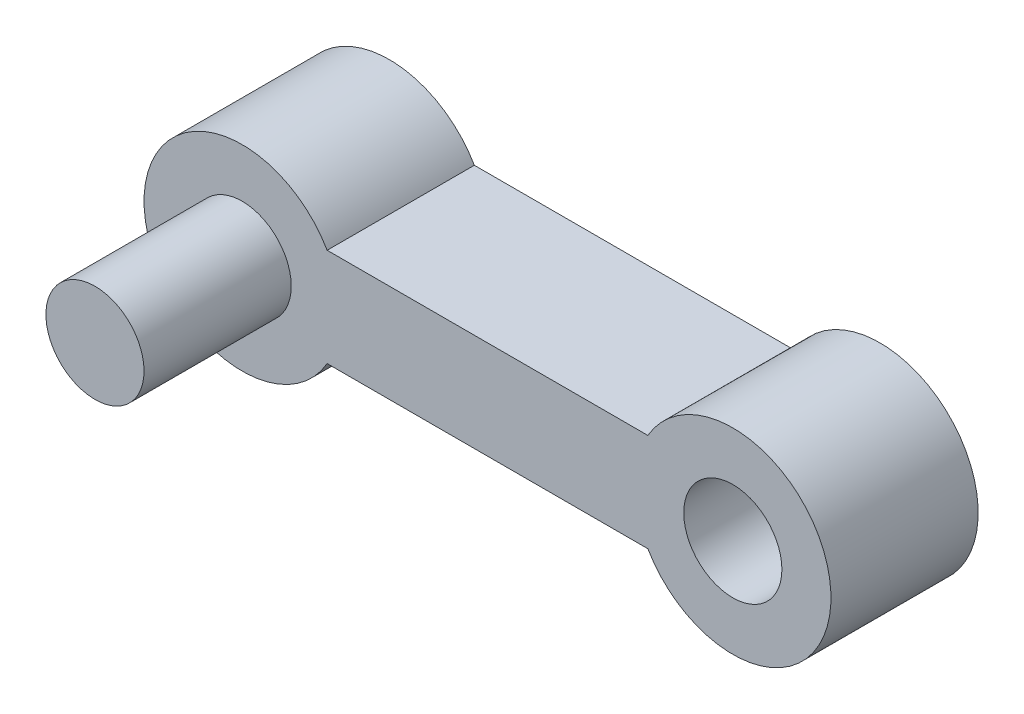
ISO-10303-21;
HEADER;
FILE_DESCRIPTION(('STEP AP214'),'2;1');
FILE_NAME('part.step','',(''),(''),'','','');
FILE_SCHEMA(('AUTOMOTIVE_DESIGN { 1 0 10303 214 1 1 1 1 }'));
ENDSEC;
DATA;
#1=APPLICATION_CONTEXT('core data for automotive mechanical design processes');
#2=APPLICATION_PROTOCOL_DEFINITION('international standard','automotive_design',2000,#1);
#3=PRODUCT_CONTEXT('',#1,'mechanical');
#4=PRODUCT('Part','Part','',(#3));
#5=PRODUCT_RELATED_PRODUCT_CATEGORY('part','',(#4));
#6=PRODUCT_DEFINITION_FORMATION('','',#4);
#7=PRODUCT_DEFINITION_CONTEXT('part definition',#1,'design');
#8=PRODUCT_DEFINITION('design','',#6,#7);
#9=PRODUCT_DEFINITION_SHAPE('','',#8);
#10=(LENGTH_UNIT() NAMED_UNIT(*) SI_UNIT(.MILLI.,.METRE.));
#11=(NAMED_UNIT(*) PLANE_ANGLE_UNIT() SI_UNIT($,.RADIAN.));
#12=(NAMED_UNIT(*) SI_UNIT($,.STERADIAN.) SOLID_ANGLE_UNIT());
#13=UNCERTAINTY_MEASURE_WITH_UNIT(LENGTH_MEASURE(1.E-05),#10,'distance_accuracy_value','');
#14=(GEOMETRIC_REPRESENTATION_CONTEXT(3) GLOBAL_UNCERTAINTY_ASSIGNED_CONTEXT((#13)) GLOBAL_UNIT_ASSIGNED_CONTEXT((#10,
#11,#12)) REPRESENTATION_CONTEXT('',''));
#15=CARTESIAN_POINT('',(0.,0.,0.));
#16=DIRECTION('',(0.,0.,1.));
#17=DIRECTION('',(1.,0.,0.));
#18=AXIS2_PLACEMENT_3D('',#15,#16,#17);
#19=CARTESIAN_POINT('',(-38.2370553074588,12.8003400418104,3.));
#20=DIRECTION('',(0.,0.,-1.));
#21=DIRECTION('',(-1.,0.,0.));
#22=AXIS2_PLACEMENT_3D('',#19,#20,#21);
#23=CYLINDRICAL_SURFACE('',#22,2.);
#24=CARTESIAN_POINT('',(-38.2370553074588,12.8003400418104,0.));
#25=DIRECTION('',(0.,0.,1.));
#26=DIRECTION('',(1.,0.,0.));
#27=AXIS2_PLACEMENT_3D('',#24,#25,#26);
#28=CIRCLE('',#27,2.);
#29=CARTESIAN_POINT('',(-36.50500449989,13.8003400418104,0.));
#30=VERTEX_POINT('',#29);
#31=CARTESIAN_POINT('',(-36.50500449989,11.8003400418104,0.));
#32=VERTEX_POINT('',#31);
#33=EDGE_CURVE('E103',#30,#32,#28,.T.);
#34=ORIENTED_EDGE('',*,*,#33,.T.);
#35=DIRECTION('',(0.,0.,-1.));
#36=VECTOR('',#35,1.);
#37=CARTESIAN_POINT('',(-36.50500449989,11.8003400418104,3.));
#38=LINE('',#37,#36);
#39=CARTESIAN_POINT('',(-36.50500449989,11.8003400418104,3.));
#40=VERTEX_POINT('',#39);
#41=EDGE_CURVE('E40',#40,#32,#38,.T.);
#42=ORIENTED_EDGE('',*,*,#41,.F.);
#43=CARTESIAN_POINT('',(-38.2370553074588,12.8003400418104,3.));
#44=DIRECTION('',(0.,0.,1.));
#45=DIRECTION('',(1.,0.,0.));
#46=AXIS2_PLACEMENT_3D('',#43,#44,#45);
#47=CIRCLE('',#46,2.);
#48=CARTESIAN_POINT('',(-36.50500449989,13.8003400418104,3.));
#49=VERTEX_POINT('',#48);
#50=EDGE_CURVE('E88',#49,#40,#47,.T.);
#51=ORIENTED_EDGE('',*,*,#50,.F.);
#52=DIRECTION('',(0.,0.,-1.));
#53=VECTOR('',#52,1.);
#54=CARTESIAN_POINT('',(-36.50500449989,13.8003400418104,3.));
#55=LINE('',#54,#53);
#56=EDGE_CURVE('E54',#49,#30,#55,.T.);
#57=ORIENTED_EDGE('',*,*,#56,.T.);
#58=EDGE_LOOP('',(#34,#42,#51,#57));
#59=FACE_BOUND('',#58,.T.);
#60=ADVANCED_FACE('F37',(#59),#23,.T.);
#61=CARTESIAN_POINT('',(0.,11.8003400418104,3.));
#62=DIRECTION('',(0.,1.,0.));
#63=DIRECTION('',(0.,0.,1.));
#64=AXIS2_PLACEMENT_3D('',#61,#62,#63);
#65=PLANE('',#64);
#66=DIRECTION('',(1.,0.,0.));
#67=VECTOR('',#66,1.);
#68=CARTESIAN_POINT('',(0.,11.8003400418104,0.));
#69=LINE('',#68,#67);
#70=CARTESIAN_POINT('',(-29.9691061150277,11.8003400418104,0.));
#71=VERTEX_POINT('',#70);
#72=EDGE_CURVE('E94',#32,#71,#69,.T.);
#73=ORIENTED_EDGE('',*,*,#72,.T.);
#74=DIRECTION('',(0.,0.,-1.));
#75=VECTOR('',#74,1.);
#76=CARTESIAN_POINT('',(-29.9691061150277,11.8003400418104,3.));
#77=LINE('',#76,#75);
#78=CARTESIAN_POINT('',(-29.9691061150277,11.8003400418104,3.));
#79=VERTEX_POINT('',#78);
#80=EDGE_CURVE('E92',#79,#71,#77,.T.);
#81=ORIENTED_EDGE('',*,*,#80,.F.);
#82=DIRECTION('',(1.,0.,0.));
#83=VECTOR('',#82,1.);
#84=CARTESIAN_POINT('',(0.,11.8003400418104,3.));
#85=LINE('',#84,#83);
#86=EDGE_CURVE('E80',#40,#79,#85,.T.);
#87=ORIENTED_EDGE('',*,*,#86,.F.);
#88=ORIENTED_EDGE('',*,*,#41,.T.);
#89=EDGE_LOOP('',(#73,#81,#87,#88));
#90=FACE_BOUND('',#89,.T.);
#91=ADVANCED_FACE('F93',(#90),#65,.F.);
#92=CARTESIAN_POINT('',(-28.2370553074588,12.8003400418104,3.));
#93=DIRECTION('',(0.,0.,-1.));
#94=DIRECTION('',(-1.,0.,0.));
#95=AXIS2_PLACEMENT_3D('',#92,#93,#94);
#96=CYLINDRICAL_SURFACE('',#95,2.);
#97=CARTESIAN_POINT('',(-28.2370553074588,12.8003400418104,0.));
#98=DIRECTION('',(0.,0.,1.));
#99=DIRECTION('',(1.,0.,0.));
#100=AXIS2_PLACEMENT_3D('',#97,#98,#99);
#101=CIRCLE('',#100,2.);
#102=CARTESIAN_POINT('',(-29.9691061150277,13.8003400418104,0.));
#103=VERTEX_POINT('',#102);
#104=EDGE_CURVE('E107',#103,#71,#101,.F.);
#105=ORIENTED_EDGE('',*,*,#104,.F.);
#106=DIRECTION('',(0.,0.,-1.));
#107=VECTOR('',#106,1.);
#108=CARTESIAN_POINT('',(-29.9691061150277,13.8003400418104,3.));
#109=LINE('',#108,#107);
#110=CARTESIAN_POINT('',(-29.9691061150277,13.8003400418104,3.));
#111=VERTEX_POINT('',#110);
#112=EDGE_CURVE('E68',#111,#103,#109,.T.);
#113=ORIENTED_EDGE('',*,*,#112,.F.);
#114=CARTESIAN_POINT('',(-28.2370553074588,12.8003400418104,3.));
#115=DIRECTION('',(0.,0.,1.));
#116=DIRECTION('',(1.,0.,0.));
#117=AXIS2_PLACEMENT_3D('',#114,#115,#116);
#118=CIRCLE('',#117,2.);
#119=EDGE_CURVE('E87',#111,#79,#118,.F.);
#120=ORIENTED_EDGE('',*,*,#119,.T.);
#121=ORIENTED_EDGE('',*,*,#80,.T.);
#122=EDGE_LOOP('',(#105,#113,#120,#121));
#123=FACE_BOUND('',#122,.T.);
#124=ADVANCED_FACE('F97',(#123),#96,.T.);
#125=CARTESIAN_POINT('',(0.,13.8003400418104,3.));
#126=DIRECTION('',(0.,1.,0.));
#127=DIRECTION('',(-1.,0.,0.));
#128=AXIS2_PLACEMENT_3D('',#125,#126,#127);
#129=PLANE('',#128);
#130=DIRECTION('',(1.,0.,0.));
#131=VECTOR('',#130,1.);
#132=CARTESIAN_POINT('',(0.,13.8003400418104,0.));
#133=LINE('',#132,#131);
#134=EDGE_CURVE('E109',#30,#103,#133,.T.);
#135=ORIENTED_EDGE('',*,*,#134,.F.);
#136=ORIENTED_EDGE('',*,*,#56,.F.);
#137=DIRECTION('',(1.,0.,0.));
#138=VECTOR('',#137,1.);
#139=CARTESIAN_POINT('',(0.,13.8003400418104,3.));
#140=LINE('',#139,#138);
#141=EDGE_CURVE('E98',#49,#111,#140,.T.);
#142=ORIENTED_EDGE('',*,*,#141,.T.);
#143=ORIENTED_EDGE('',*,*,#112,.T.);
#144=EDGE_LOOP('',(#135,#136,#142,#143));
#145=FACE_BOUND('',#144,.T.);
#146=ADVANCED_FACE('F131',(#145),#129,.T.);
#147=CARTESIAN_POINT('',(0.,0.,3.));
#148=DIRECTION('',(0.,0.,1.));
#149=DIRECTION('',(1.,0.,0.));
#150=AXIS2_PLACEMENT_3D('',#147,#148,#149);
#151=PLANE('',#150);
#152=CARTESIAN_POINT('',(-28.2370553074588,12.8003400418104,3.));
#153=DIRECTION('',(0.,0.,1.));
#154=DIRECTION('',(1.,0.,0.));
#155=AXIS2_PLACEMENT_3D('',#152,#153,#154);
#156=CIRCLE('',#155,1.);
#157=CARTESIAN_POINT('',(-27.2370553074588,12.8003400418104,3.));
#158=VERTEX_POINT('',#157);
#159=EDGE_CURVE('E117',#158,#158,#156,.F.);
#160=ORIENTED_EDGE('',*,*,#159,.T.);
#161=EDGE_LOOP('',(#160));
#162=FACE_BOUND('',#161,.T.);
#163=CARTESIAN_POINT('',(-38.2370553074588,12.8003400418104,3.));
#164=DIRECTION('',(0.,0.,1.));
#165=DIRECTION('',(1.,0.,0.));
#166=AXIS2_PLACEMENT_3D('',#163,#164,#165);
#167=CIRCLE('',#166,0.999999999999998);
#168=CARTESIAN_POINT('',(-37.2370553074588,12.8003400418104,3.));
#169=VERTEX_POINT('',#168);
#170=EDGE_CURVE('E11',#169,#169,#167,.T.);
#171=ORIENTED_EDGE('',*,*,#170,.F.);
#172=EDGE_LOOP('',(#171));
#173=FACE_BOUND('',#172,.T.);
#174=ORIENTED_EDGE('',*,*,#50,.T.);
#175=ORIENTED_EDGE('',*,*,#86,.T.);
#176=ORIENTED_EDGE('',*,*,#119,.F.);
#177=ORIENTED_EDGE('',*,*,#141,.F.);
#178=EDGE_LOOP('',(#174,#175,#176,#177));
#179=FACE_BOUND('',#178,.T.);
#180=ADVANCED_FACE('F84',(#162,#173,#179),#151,.T.);
#181=CARTESIAN_POINT('',(0.,0.,0.));
#182=DIRECTION('',(0.,0.,1.));
#183=DIRECTION('',(1.,0.,0.));
#184=AXIS2_PLACEMENT_3D('',#181,#182,#183);
#185=PLANE('',#184);
#186=CARTESIAN_POINT('',(-28.2370553074588,12.8003400418104,0.));
#187=DIRECTION('',(0.,0.,-1.));
#188=DIRECTION('',(-1.,0.,0.));
#189=AXIS2_PLACEMENT_3D('',#186,#187,#188);
#190=CIRCLE('',#189,1.);
#191=CARTESIAN_POINT('',(-29.2370553074588,12.8003400418104,0.));
#192=VERTEX_POINT('',#191);
#193=EDGE_CURVE('E120',#192,#192,#190,.T.);
#194=ORIENTED_EDGE('',*,*,#193,.F.);
#195=EDGE_LOOP('',(#194));
#196=FACE_BOUND('',#195,.T.);
#197=ORIENTED_EDGE('',*,*,#33,.F.);
#198=ORIENTED_EDGE('',*,*,#134,.T.);
#199=ORIENTED_EDGE('',*,*,#104,.T.);
#200=ORIENTED_EDGE('',*,*,#72,.F.);
#201=EDGE_LOOP('',(#197,#198,#199,#200));
#202=FACE_BOUND('',#201,.T.);
#203=ADVANCED_FACE('F127',(#196,#202),#185,.F.);
#204=CARTESIAN_POINT('',(-38.2370553074588,12.8003400418104,6.));
#205=DIRECTION('',(0.,0.,-1.));
#206=DIRECTION('',(-1.,0.,0.));
#207=AXIS2_PLACEMENT_3D('',#204,#205,#206);
#208=CYLINDRICAL_SURFACE('',#207,0.999999999999998);
#209=CARTESIAN_POINT('',(-38.2370553074588,12.8003400418104,6.));
#210=DIRECTION('',(0.,0.,1.));
#211=DIRECTION('',(1.,0.,0.));
#212=AXIS2_PLACEMENT_3D('',#209,#210,#211);
#213=CIRCLE('',#212,0.999999999999998);
#214=CARTESIAN_POINT('',(-37.2370553074588,12.8003400418104,6.));
#215=VERTEX_POINT('',#214);
#216=EDGE_CURVE('E105',#215,#215,#213,.T.);
#217=ORIENTED_EDGE('',*,*,#216,.F.);
#218=EDGE_LOOP('',(#217));
#219=FACE_BOUND('',#218,.T.);
#220=ORIENTED_EDGE('',*,*,#170,.T.);
#221=EDGE_LOOP('',(#220));
#222=FACE_BOUND('',#221,.T.);
#223=ADVANCED_FACE('F129',(#219,#222),#208,.T.);
#224=CARTESIAN_POINT('',(-38.2370553074588,12.8003400418104,6.));
#225=DIRECTION('',(0.,0.,1.));
#226=DIRECTION('',(1.,0.,0.));
#227=AXIS2_PLACEMENT_3D('',#224,#225,#226);
#228=PLANE('',#227);
#229=ORIENTED_EDGE('',*,*,#216,.T.);
#230=EDGE_LOOP('',(#229));
#231=FACE_BOUND('',#230,.T.);
#232=ADVANCED_FACE('F165',(#231),#228,.T.);
#233=CARTESIAN_POINT('',(-28.2370553074588,12.8003400418104,5.8284271247462));
#234=DIRECTION('',(0.,0.,-1.));
#235=DIRECTION('',(-1.,0.,0.));
#236=AXIS2_PLACEMENT_3D('',#233,#234,#235);
#237=CYLINDRICAL_SURFACE('',#236,1.);
#238=ORIENTED_EDGE('',*,*,#193,.T.);
#239=EDGE_LOOP('',(#238));
#240=FACE_BOUND('',#239,.T.);
#241=ORIENTED_EDGE('',*,*,#159,.F.);
#242=EDGE_LOOP('',(#241));
#243=FACE_BOUND('',#242,.T.);
#244=ADVANCED_FACE('F124',(#240,#243),#237,.F.);
#245=CLOSED_SHELL('',(#60,#91,#124,#146,#180,#203,#223,#232,#244));
#246=MANIFOLD_SOLID_BREP('B2',#245);
#247=ADVANCED_BREP_SHAPE_REPRESENTATION('',(#18,#246),#14);
#248=SHAPE_DEFINITION_REPRESENTATION(#9,#247);
ENDSEC;
END-ISO-10303-21;
